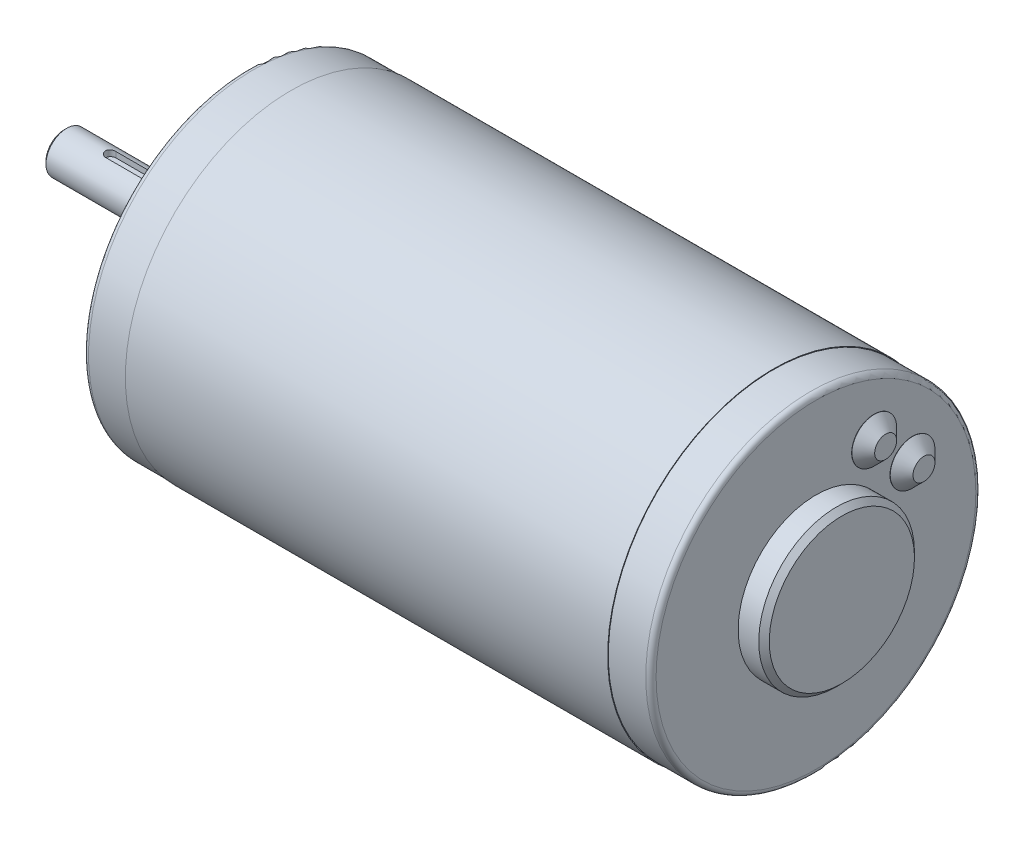
ISO-10303-21;
HEADER;
FILE_DESCRIPTION(('STEP AP214'),'2;1');
FILE_NAME('part.step','',(''),(''),'','','');
FILE_SCHEMA(('AUTOMOTIVE_DESIGN { 1 0 10303 214 1 1 1 1 }'));
ENDSEC;
DATA;
#1=APPLICATION_CONTEXT('core data for automotive mechanical design processes');
#2=APPLICATION_PROTOCOL_DEFINITION('international standard','automotive_design',2000,#1);
#3=PRODUCT_CONTEXT('',#1,'mechanical');
#4=PRODUCT('Part','Part','',(#3));
#5=PRODUCT_RELATED_PRODUCT_CATEGORY('part','',(#4));
#6=PRODUCT_DEFINITION_FORMATION('','',#4);
#7=PRODUCT_DEFINITION_CONTEXT('part definition',#1,'design');
#8=PRODUCT_DEFINITION('design','',#6,#7);
#9=PRODUCT_DEFINITION_SHAPE('','',#8);
#10=(LENGTH_UNIT() NAMED_UNIT(*) SI_UNIT(.MILLI.,.METRE.));
#11=(NAMED_UNIT(*) PLANE_ANGLE_UNIT() SI_UNIT($,.RADIAN.));
#12=(NAMED_UNIT(*) SI_UNIT($,.STERADIAN.) SOLID_ANGLE_UNIT());
#13=UNCERTAINTY_MEASURE_WITH_UNIT(LENGTH_MEASURE(1.E-05),#10,'distance_accuracy_value','');
#14=(GEOMETRIC_REPRESENTATION_CONTEXT(3) GLOBAL_UNCERTAINTY_ASSIGNED_CONTEXT((#13)) GLOBAL_UNIT_ASSIGNED_CONTEXT((#10,
#11,#12)) REPRESENTATION_CONTEXT('',''));
#15=CARTESIAN_POINT('',(0.,0.,0.));
#16=DIRECTION('',(0.,0.,1.));
#17=DIRECTION('',(1.,0.,0.));
#18=AXIS2_PLACEMENT_3D('',#15,#16,#17);
#19=CARTESIAN_POINT('',(-27.6,2.79999999999999,-1.));
#20=DIRECTION('',(0.,-1.,0.));
#21=DIRECTION('',(0.,0.,-1.));
#22=AXIS2_PLACEMENT_3D('',#19,#20,#21);
#23=PLANE('',#22);
#24=CARTESIAN_POINT('',(-7.1,2.79999999999999,0.));
#25=DIRECTION('',(0.,1.,0.));
#26=DIRECTION('',(0.,0.,1.));
#27=AXIS2_PLACEMENT_3D('',#24,#25,#26);
#28=CIRCLE('',#27,1.);
#29=CARTESIAN_POINT('',(-7.1,2.79999999999999,1.));
#30=VERTEX_POINT('',#29);
#31=CARTESIAN_POINT('',(-7.1,2.79999999999999,-1.));
#32=VERTEX_POINT('',#31);
#33=EDGE_CURVE('E81',#30,#32,#28,.T.);
#34=ORIENTED_EDGE('',*,*,#33,.T.);
#35=DIRECTION('',(1.,0.,0.));
#36=VECTOR('',#35,1.);
#37=CARTESIAN_POINT('',(-27.6,2.79999999999999,-1.));
#38=LINE('',#37,#36);
#39=CARTESIAN_POINT('',(-26.6,2.79999999999999,-1.));
#40=VERTEX_POINT('',#39);
#41=EDGE_CURVE('E76',#40,#32,#38,.T.);
#42=ORIENTED_EDGE('',*,*,#41,.F.);
#43=CARTESIAN_POINT('',(-26.6,2.79999999999999,0.));
#44=DIRECTION('',(0.,-1.,0.));
#45=DIRECTION('',(0.,0.,-1.));
#46=AXIS2_PLACEMENT_3D('',#43,#44,#45);
#47=CIRCLE('',#46,1.);
#48=CARTESIAN_POINT('',(-26.6,2.79999999999999,1.));
#49=VERTEX_POINT('',#48);
#50=EDGE_CURVE('E78',#40,#49,#47,.F.);
#51=ORIENTED_EDGE('',*,*,#50,.T.);
#52=DIRECTION('',(1.,0.,0.));
#53=VECTOR('',#52,1.);
#54=CARTESIAN_POINT('',(-27.6,2.79999999999999,1.));
#55=LINE('',#54,#53);
#56=EDGE_CURVE('E104',#49,#30,#55,.T.);
#57=ORIENTED_EDGE('',*,*,#56,.T.);
#58=EDGE_LOOP('',(#34,#42,#51,#57));
#59=FACE_BOUND('',#58,.T.);
#60=ADVANCED_FACE('F18',(#59),#23,.F.);
#61=CARTESIAN_POINT('',(-35.6,0.,0.));
#62=DIRECTION('',(-1.,0.,0.));
#63=DIRECTION('',(0.,0.,1.));
#64=AXIS2_PLACEMENT_3D('',#61,#62,#63);
#65=PLANE('',#64);
#66=CARTESIAN_POINT('',(-35.6000000000449,0.,0.));
#67=DIRECTION('',(1.,0.,0.));
#68=DIRECTION('',(0.,0.,-1.));
#69=AXIS2_PLACEMENT_3D('',#66,#67,#68);
#70=CIRCLE('',#69,3.49999999997408);
#71=CARTESIAN_POINT('',(-35.6000000000449,0.,-3.49999999997408));
#72=VERTEX_POINT('',#71);
#73=EDGE_CURVE('E326',#72,#72,#70,.T.);
#74=ORIENTED_EDGE('',*,*,#73,.F.);
#75=EDGE_LOOP('',(#74));
#76=FACE_BOUND('',#75,.T.);
#77=ADVANCED_FACE('F582',(#76),#65,.T.);
#78=CARTESIAN_POINT('',(-26.6,3.87298334620741,0.));
#79=DIRECTION('',(0.,-1.,0.));
#80=DIRECTION('',(0.,0.,-1.));
#81=AXIS2_PLACEMENT_3D('',#78,#79,#80);
#82=CYLINDRICAL_SURFACE('',#81,1.);
#83=CARTESIAN_POINT('',(-26.6,3.87298334620741,1.));
#84=CARTESIAN_POINT('',(-26.6276629851065,3.87298148580177,1.00000033749611));
#85=CARTESIAN_POINT('',(-26.6553122630182,3.8732800994947,0.998851407375366));
#86=CARTESIAN_POINT('',(-26.7104040353036,3.87445904774558,0.994271295395754));
#87=CARTESIAN_POINT('',(-26.7378465636871,3.87533928441687,0.990840497572679));
#88=CARTESIAN_POINT('',(-26.8194531732088,3.87881710972053,0.977175239382526));
#89=CARTESIAN_POINT('',(-26.8730564684822,3.88225203148808,0.963567695172493));
#90=CARTESIAN_POINT('',(-26.977124673782,3.89095422588002,0.927798076247996));
#91=CARTESIAN_POINT('',(-27.0275898782129,3.89622132630929,0.905636805423835));
#92=CARTESIAN_POINT('',(-27.1241114486473,3.90799134471939,0.853415378025864));
#93=CARTESIAN_POINT('',(-27.170166627891,3.91449459395647,0.823353103356932));
#94=CARTESIAN_POINT('',(-27.2575438819061,3.92816262398025,0.755484471828069));
#95=CARTESIAN_POINT('',(-27.2987548862455,3.93533791028915,0.717537268783975));
#96=CARTESIAN_POINT('',(-27.3743020894827,3.94945104396193,0.635275780516229));
#97=CARTESIAN_POINT('',(-27.4086371894679,3.95638885322537,0.59096047947883));
#98=CARTESIAN_POINT('',(-27.4699110016186,3.96936182283248,0.496456899401689));
#99=CARTESIAN_POINT('',(-27.496739895984,3.9753830468173,0.446195340334472));
#100=CARTESIAN_POINT('',(-27.5415247341967,3.98572346250588,0.341702590842916));
#101=CARTESIAN_POINT('',(-27.5594824242998,3.990042989147,0.287472184083007));
#102=CARTESIAN_POINT('',(-27.5856589927774,3.99641900005128,0.177744108525158));
#103=CARTESIAN_POINT('',(-27.5940676724228,3.998519529013,0.122294322002856));
#104=CARTESIAN_POINT('',(-27.6015033715433,4.00037438150815,0.0107327756816781));
#105=CARTESIAN_POINT('',(-27.6005315701923,4.00012899993444,-0.0453789000287067));
#106=CARTESIAN_POINT('',(-27.5893700363146,3.99735237365735,-0.155352492972096));
#107=CARTESIAN_POINT('',(-27.5793853834005,3.9948719867736,-0.209236701739855));
#108=CARTESIAN_POINT('',(-27.5508113208173,3.98796330636495,-0.31453871108434));
#109=CARTESIAN_POINT('',(-27.5322215304314,3.98353492665556,-0.365956402423988));
#110=CARTESIAN_POINT('',(-27.4867987193294,3.97314997761798,-0.46540728602454));
#111=CARTESIAN_POINT('',(-27.4598926057672,3.96717993827555,-0.513405629602248));
#112=CARTESIAN_POINT('',(-27.3986568701665,3.95435945541919,-0.604276631230015));
#113=CARTESIAN_POINT('',(-27.3643261297468,3.94750887933198,-0.64714851556229));
#114=CARTESIAN_POINT('',(-27.2881210879187,3.93345566022865,-0.727769389708492));
#115=CARTESIAN_POINT('',(-27.2460683634602,3.92624850477685,-0.765349103054128));
#116=CARTESIAN_POINT('',(-27.1561701330723,3.91246168284006,-0.832969575186237));
#117=CARTESIAN_POINT('',(-27.1083230467164,3.90588218842993,-0.863008270245062));
#118=CARTESIAN_POINT('',(-27.0078544021762,3.89407813586325,-0.914804709285961));
#119=CARTESIAN_POINT('',(-26.9552085351039,3.88886106009136,-0.936517017887269));
#120=CARTESIAN_POINT('',(-26.8468830715817,3.88047058807054,-0.970702351849828));
#121=CARTESIAN_POINT('',(-26.7912081448502,3.87729413761435,-0.983189189212131));
#122=CARTESIAN_POINT('',(-26.7125426192411,3.87455290681524,-0.993904635150938));
#123=CARTESIAN_POINT('',(-26.6900802967868,3.87396523110859,-0.996190790966708));
#124=CARTESIAN_POINT('',(-26.6450822100907,3.87318062488974,-0.999236757697394));
#125=CARTESIAN_POINT('',(-26.6225466240447,3.87298306219461,-0.999999038096045));
#126=CARTESIAN_POINT('',(-26.6,3.87298334620741,-1.));
#127=B_SPLINE_CURVE_WITH_KNOTS('',3,(#83,#84,#85,#86,#87,#88,#89,#90,#91,#92,#93,#94,#95,#96,
#97,#98,#99,#100,#101,#102,#103,#104,#105,#106,#107,#108,#109,#110,#111,#112,#113,#114,#115,
#116,#117,#118,#119,#120,#121,#122,#123,#124,#125,#126),.UNSPECIFIED.,.F.,.F.,(4,2,2,2,2,2,2,2,
2,2,2,2,2,2,2,2,2,2,2,2,2,4),(0.,0.0829365303397727,0.165859106084653,0.331229963080318,
0.496585282091499,0.661984974726751,0.830641897427976,0.999325753539196,1.17036187098235,
1.34136430732425,1.50890481515325,1.67642426256639,1.84022545479276,2.00403389475838,
2.16932509450376,2.33464120964329,2.50441429534542,2.67423379180967,2.84496720161068,
3.01544447539986,3.08315848722649,3.15076267731671),.UNSPECIFIED.);
#128=CARTESIAN_POINT('',(-26.6,3.87298334620741,1.));
#129=VERTEX_POINT('',#128);
#130=CARTESIAN_POINT('',(-26.6,3.87298334620741,-1.));
#131=VERTEX_POINT('',#130);
#132=EDGE_CURVE('E162',#129,#131,#127,.T.);
#133=ORIENTED_EDGE('',*,*,#132,.F.);
#134=DIRECTION('',(0.,1.,0.));
#135=VECTOR('',#134,1.);
#136=CARTESIAN_POINT('',(-26.6,2.79999999999999,1.));
#137=LINE('',#136,#135);
#138=EDGE_CURVE('E91',#129,#49,#137,.F.);
#139=ORIENTED_EDGE('',*,*,#138,.T.);
#140=ORIENTED_EDGE('',*,*,#50,.F.);
#141=DIRECTION('',(0.,1.,0.));
#142=VECTOR('',#141,1.);
#143=CARTESIAN_POINT('',(-26.6,2.79999999999999,-1.));
#144=LINE('',#143,#142);
#145=EDGE_CURVE('E85',#131,#40,#144,.F.);
#146=ORIENTED_EDGE('',*,*,#145,.F.);
#147=EDGE_LOOP('',(#133,#139,#140,#146));
#148=FACE_BOUND('',#147,.T.);
#149=ADVANCED_FACE('F88',(#148),#82,.F.);
#150=CARTESIAN_POINT('',(-27.6,2.79999999999999,-1.));
#151=DIRECTION('',(0.,0.,1.));
#152=DIRECTION('',(1.,0.,0.));
#153=AXIS2_PLACEMENT_3D('',#150,#151,#152);
#154=PLANE('',#153);
#155=DIRECTION('',(1.,0.,0.));
#156=VECTOR('',#155,1.);
#157=CARTESIAN_POINT('',(0.,3.87298334620741,-1.));
#158=LINE('',#157,#156);
#159=CARTESIAN_POINT('',(-7.1,3.87298334620741,-1.));
#160=VERTEX_POINT('',#159);
#161=EDGE_CURVE('E96',#131,#160,#158,.T.);
#162=ORIENTED_EDGE('',*,*,#161,.F.);
#163=ORIENTED_EDGE('',*,*,#145,.T.);
#164=ORIENTED_EDGE('',*,*,#41,.T.);
#165=DIRECTION('',(0.,1.,0.));
#166=VECTOR('',#165,1.);
#167=CARTESIAN_POINT('',(-7.1,2.79999999999999,-1.));
#168=LINE('',#167,#166);
#169=EDGE_CURVE('E99',#32,#160,#168,.T.);
#170=ORIENTED_EDGE('',*,*,#169,.T.);
#171=EDGE_LOOP('',(#162,#163,#164,#170));
#172=FACE_BOUND('',#171,.T.);
#173=ADVANCED_FACE('F94',(#172),#154,.T.);
#174=CARTESIAN_POINT('',(-7.1,2.79999999999999,0.));
#175=DIRECTION('',(0.,1.,0.));
#176=DIRECTION('',(0.,0.,1.));
#177=AXIS2_PLACEMENT_3D('',#174,#175,#176);
#178=CYLINDRICAL_SURFACE('',#177,1.);
#179=ORIENTED_EDGE('',*,*,#33,.F.);
#180=DIRECTION('',(0.,1.,0.));
#181=VECTOR('',#180,1.);
#182=CARTESIAN_POINT('',(-7.1,2.79999999999999,1.));
#183=LINE('',#182,#181);
#184=CARTESIAN_POINT('',(-7.1,3.87298334620741,1.));
#185=VERTEX_POINT('',#184);
#186=EDGE_CURVE('E105',#30,#185,#183,.T.);
#187=ORIENTED_EDGE('',*,*,#186,.T.);
#188=CARTESIAN_POINT('',(-7.1,3.87298334620741,-1.));
#189=CARTESIAN_POINT('',(-7.07233701489346,3.87298148580177,-1.00000033749611));
#190=CARTESIAN_POINT('',(-7.04468773698177,3.8732800994947,-0.998851407375366));
#191=CARTESIAN_POINT('',(-6.98959596469644,3.87445904774558,-0.994271295395754));
#192=CARTESIAN_POINT('',(-6.96215343631291,3.87533928441687,-0.990840497572679));
#193=CARTESIAN_POINT('',(-6.88054682679116,3.87881710972053,-0.977175239382526));
#194=CARTESIAN_POINT('',(-6.82694353151779,3.88225203148808,-0.963567695172493));
#195=CARTESIAN_POINT('',(-6.72287532621804,3.89095422588002,-0.927798076247997));
#196=CARTESIAN_POINT('',(-6.67241012178714,3.89622132630929,-0.905636805423836));
#197=CARTESIAN_POINT('',(-6.57588855135267,3.90799134471939,-0.853415378025865));
#198=CARTESIAN_POINT('',(-6.52983337210904,3.91449459395647,-0.823353103356933));
#199=CARTESIAN_POINT('',(-6.4424561180939,3.92816262398025,-0.755484471828069));
#200=CARTESIAN_POINT('',(-6.40124511375448,3.93533791028915,-0.717537268783976));
#201=CARTESIAN_POINT('',(-6.32569791051729,3.94945104396193,-0.63527578051623));
#202=CARTESIAN_POINT('',(-6.29136281053206,3.95638885322537,-0.590960479478831));
#203=CARTESIAN_POINT('',(-6.23008899838136,3.96936182283248,-0.496456899401691));
#204=CARTESIAN_POINT('',(-6.20326010401603,3.9753830468173,-0.446195340334474));
#205=CARTESIAN_POINT('',(-6.1584752658033,3.98572346250588,-0.341702590842919));
#206=CARTESIAN_POINT('',(-6.14051757570017,3.990042989147,-0.28747218408301));
#207=CARTESIAN_POINT('',(-6.11434100722257,3.99641900005128,-0.17774410852516));
#208=CARTESIAN_POINT('',(-6.10593232757718,3.998519529013,-0.122294322002858));
#209=CARTESIAN_POINT('',(-6.09849662845671,4.00037438150815,-0.0107327756816796));
#210=CARTESIAN_POINT('',(-6.09946842980766,4.00012899993444,0.0453789000287057));
#211=CARTESIAN_POINT('',(-6.11062996368545,3.99735237365735,0.155352492972096));
#212=CARTESIAN_POINT('',(-6.12061461659948,3.9948719867736,0.209236701739855));
#213=CARTESIAN_POINT('',(-6.14918867918275,3.98796330636495,0.31453871108434));
#214=CARTESIAN_POINT('',(-6.16777846956858,3.98353492665556,0.365956402423988));
#215=CARTESIAN_POINT('',(-6.21320128067065,3.97314997761798,0.465407286024539));
#216=CARTESIAN_POINT('',(-6.24010739423284,3.96717993827555,0.513405629602248));
#217=CARTESIAN_POINT('',(-6.30134312983347,3.95435945541919,0.604276631230014));
#218=CARTESIAN_POINT('',(-6.33567387025322,3.94750887933198,0.647148515562289));
#219=CARTESIAN_POINT('',(-6.41187891208131,3.93345566022865,0.72776938970849));
#220=CARTESIAN_POINT('',(-6.45393163653981,3.92624850477685,0.765349103054127));
#221=CARTESIAN_POINT('',(-6.54382986692773,3.91246168284006,0.832969575186237));
#222=CARTESIAN_POINT('',(-6.59167695328356,3.90588218842993,0.863008270245062));
#223=CARTESIAN_POINT('',(-6.69214559782377,3.89407813586325,0.914804709285962));
#224=CARTESIAN_POINT('',(-6.74479146489609,3.88886106009136,0.936517017887269));
#225=CARTESIAN_POINT('',(-6.85311692841829,3.88047058807055,0.970702351849829));
#226=CARTESIAN_POINT('',(-6.90879185514984,3.87729413761435,0.983189189212132));
#227=CARTESIAN_POINT('',(-6.9874573807589,3.87455290681524,0.993904635150938));
#228=CARTESIAN_POINT('',(-7.00991970321318,3.87396523110859,0.996190790966708));
#229=CARTESIAN_POINT('',(-7.05491778990932,3.87318062488974,0.999236757697394));
#230=CARTESIAN_POINT('',(-7.07745337595529,3.87298306219461,0.999999038096045));
#231=CARTESIAN_POINT('',(-7.1,3.87298334620741,1.));
#232=B_SPLINE_CURVE_WITH_KNOTS('',3,(#188,#189,#190,#191,#192,#193,#194,#195,#196,#197,#198,
#199,#200,#201,#202,#203,#204,#205,#206,#207,#208,#209,#210,#211,#212,#213,#214,#215,#216,#217,
#218,#219,#220,#221,#222,#223,#224,#225,#226,#227,#228,#229,#230,#231),.UNSPECIFIED.,.F.,.F.,(4,
2,2,2,2,2,2,2,2,2,2,2,2,2,2,2,2,2,2,2,2,4),(0.,0.0829365303397693,0.165859106084651,
0.331229963080317,0.496585282091498,0.661984974726749,0.830641897427974,0.999325753539193,
1.17036187098235,1.34136430732424,1.50890481515325,1.67642426256639,1.84022545479276,
2.00403389475838,2.16932509450376,2.33464120964329,2.50441429534542,2.67423379180967,
2.84496720161068,3.01544447539986,3.08315848722648,3.15076267731671),.UNSPECIFIED.);
#233=EDGE_CURVE('E153',#160,#185,#232,.T.);
#234=ORIENTED_EDGE('',*,*,#233,.F.);
#235=ORIENTED_EDGE('',*,*,#169,.F.);
#236=EDGE_LOOP('',(#179,#187,#234,#235));
#237=FACE_BOUND('',#236,.T.);
#238=ADVANCED_FACE('F168',(#237),#178,.F.);
#239=CARTESIAN_POINT('',(-27.6,2.79999999999999,1.));
#240=DIRECTION('',(0.,0.,1.));
#241=DIRECTION('',(1.,0.,0.));
#242=AXIS2_PLACEMENT_3D('',#239,#240,#241);
#243=PLANE('',#242);
#244=ORIENTED_EDGE('',*,*,#186,.F.);
#245=ORIENTED_EDGE('',*,*,#56,.F.);
#246=ORIENTED_EDGE('',*,*,#138,.F.);
#247=DIRECTION('',(1.,0.,0.));
#248=VECTOR('',#247,1.);
#249=CARTESIAN_POINT('',(0.,3.87298334620741,1.));
#250=LINE('',#249,#248);
#251=EDGE_CURVE('E161',#185,#129,#250,.F.);
#252=ORIENTED_EDGE('',*,*,#251,.F.);
#253=EDGE_LOOP('',(#244,#245,#246,#252));
#254=FACE_BOUND('',#253,.T.);
#255=ADVANCED_FACE('F183',(#254),#243,.F.);
#256=CARTESIAN_POINT('',(-35.0999999999999,0.,0.));
#257=DIRECTION('',(1.,0.,0.));
#258=DIRECTION('',(0.,0.,-1.));
#259=AXIS2_PLACEMENT_3D('',#256,#257,#258);
#260=CONICAL_SURFACE('',#259,3.99999999996226,0.785398163340605);
#261=ORIENTED_EDGE('',*,*,#73,.T.);
#262=EDGE_LOOP('',(#261));
#263=FACE_BOUND('',#262,.T.);
#264=CARTESIAN_POINT('',(-35.1,0.,0.));
#265=DIRECTION('',(1.,0.,0.));
#266=DIRECTION('',(0.,0.,-1.));
#267=AXIS2_PLACEMENT_3D('',#264,#265,#266);
#268=CIRCLE('',#267,4.);
#269=CARTESIAN_POINT('',(-35.1,0.,-4.));
#270=VERTEX_POINT('',#269);
#271=EDGE_CURVE('E152',#270,#270,#268,.T.);
#272=ORIENTED_EDGE('',*,*,#271,.F.);
#273=EDGE_LOOP('',(#272));
#274=FACE_BOUND('',#273,.T.);
#275=ADVANCED_FACE('F178',(#263,#274),#260,.T.);
#276=CARTESIAN_POINT('',(0.,0.,0.));
#277=DIRECTION('',(1.,0.,0.));
#278=DIRECTION('',(0.,0.,-1.));
#279=AXIS2_PLACEMENT_3D('',#276,#277,#278);
#280=CYLINDRICAL_SURFACE('',#279,4.);
#281=ORIENTED_EDGE('',*,*,#271,.T.);
#282=EDGE_LOOP('',(#281));
#283=FACE_BOUND('',#282,.T.);
#284=CARTESIAN_POINT('',(-4.,0.,0.));
#285=DIRECTION('',(1.,0.,0.));
#286=DIRECTION('',(0.,0.,-1.));
#287=AXIS2_PLACEMENT_3D('',#284,#285,#286);
#288=CIRCLE('',#287,4.);
#289=CARTESIAN_POINT('',(-4.,0.,-4.));
#290=VERTEX_POINT('',#289);
#291=EDGE_CURVE('E149',#290,#290,#288,.T.);
#292=ORIENTED_EDGE('',*,*,#291,.F.);
#293=EDGE_LOOP('',(#292));
#294=FACE_BOUND('',#293,.T.);
#295=ORIENTED_EDGE('',*,*,#233,.T.);
#296=ORIENTED_EDGE('',*,*,#251,.T.);
#297=ORIENTED_EDGE('',*,*,#132,.T.);
#298=ORIENTED_EDGE('',*,*,#161,.T.);
#299=EDGE_LOOP('',(#295,#296,#297,#298));
#300=FACE_BOUND('',#299,.T.);
#301=ADVANCED_FACE('F172',(#283,#294,#300),#280,.T.);
#302=CARTESIAN_POINT('',(-4.,4.,0.));
#303=DIRECTION('',(-1.,0.,0.));
#304=DIRECTION('',(0.,0.,1.));
#305=AXIS2_PLACEMENT_3D('',#302,#303,#304);
#306=PLANE('',#305);
#307=ORIENTED_EDGE('',*,*,#291,.T.);
#308=EDGE_LOOP('',(#307));
#309=FACE_BOUND('',#308,.T.);
#310=CARTESIAN_POINT('',(-4.,0.,0.));
#311=DIRECTION('',(1.,0.,0.));
#312=DIRECTION('',(0.,1.,0.));
#313=AXIS2_PLACEMENT_3D('',#310,#311,#312);
#314=CIRCLE('',#313,8.509);
#315=CARTESIAN_POINT('',(-4.,8.509,0.));
#316=VERTEX_POINT('',#315);
#317=EDGE_CURVE('E146',#316,#316,#314,.T.);
#318=ORIENTED_EDGE('',*,*,#317,.F.);
#319=EDGE_LOOP('',(#318));
#320=FACE_BOUND('',#319,.T.);
#321=ADVANCED_FACE('F177',(#309,#320),#306,.T.);
#322=CARTESIAN_POINT('',(111.8479,18.6070906828553,-11.2073596390943));
#323=DIRECTION('',(1.,0.,0.));
#324=DIRECTION('',(0.,0.,-1.));
#325=AXIS2_PLACEMENT_3D('',#322,#323,#324);
#326=PLANE('',#325);
#327=CARTESIAN_POINT('',(111.84789999993,18.6070906828553,-11.2073596390943));
#328=DIRECTION('',(-1.,0.,0.));
#329=DIRECTION('',(0.,-1.,0.));
#330=AXIS2_PLACEMENT_3D('',#327,#328,#329);
#331=CIRCLE('',#330,2.11800000003146);
#332=CARTESIAN_POINT('',(111.84789999993,16.4890906828238,-11.2073596390943));
#333=VERTEX_POINT('',#332);
#334=EDGE_CURVE('E143',#333,#333,#331,.T.);
#335=ORIENTED_EDGE('',*,*,#334,.F.);
#336=EDGE_LOOP('',(#335));
#337=FACE_BOUND('',#336,.T.);
#338=ADVANCED_FACE('F534',(#337),#326,.T.);
#339=CARTESIAN_POINT('',(114.6,15.0368,0.));
#340=DIRECTION('',(1.,0.,0.));
#341=DIRECTION('',(0.,0.,-1.));
#342=AXIS2_PLACEMENT_3D('',#339,#340,#341);
#343=PLANE('',#342);
#344=CARTESIAN_POINT('',(114.6,0.,0.));
#345=DIRECTION('',(-1.,0.,0.));
#346=DIRECTION('',(0.,-1.,0.));
#347=AXIS2_PLACEMENT_3D('',#344,#345,#346);
#348=CIRCLE('',#347,14.0208);
#349=CARTESIAN_POINT('',(114.6,-14.0208,0.));
#350=VERTEX_POINT('',#349);
#351=EDGE_CURVE('E140',#350,#350,#348,.T.);
#352=ORIENTED_EDGE('',*,*,#351,.F.);
#353=EDGE_LOOP('',(#352));
#354=FACE_BOUND('',#353,.T.);
#355=ADVANCED_FACE('F525',(#354),#343,.T.);
#356=CARTESIAN_POINT('',(111.8479,11.2073596390943,-18.6070906828553));
#357=DIRECTION('',(1.,0.,0.));
#358=DIRECTION('',(0.,0.,-1.));
#359=AXIS2_PLACEMENT_3D('',#356,#357,#358);
#360=PLANE('',#359);
#361=CARTESIAN_POINT('',(111.84789999993,11.2073596390943,-18.6070906828553));
#362=DIRECTION('',(-1.,0.,0.));
#363=DIRECTION('',(0.,0.,1.));
#364=AXIS2_PLACEMENT_3D('',#361,#362,#363);
#365=CIRCLE('',#364,2.1180000000021);
#366=CARTESIAN_POINT('',(111.84789999993,11.2073596390943,-16.4890906828532));
#367=VERTEX_POINT('',#366);
#368=EDGE_CURVE('E136',#367,#367,#365,.T.);
#369=ORIENTED_EDGE('',*,*,#368,.F.);
#370=EDGE_LOOP('',(#369));
#371=FACE_BOUND('',#370,.T.);
#372=ADVANCED_FACE('F516',(#371),#360,.T.);
#373=CARTESIAN_POINT('',(13.6143999999945,25.4,0.));
#374=DIRECTION('',(-1.,0.,0.));
#375=DIRECTION('',(0.,0.,1.));
#376=AXIS2_PLACEMENT_3D('',#373,#374,#375);
#377=CONICAL_SURFACE('',#376,2.01929999997219,1.02974425867198);
#378=CARTESIAN_POINT('',(14.827717847993,25.4,0.));
#379=VERTEX_POINT('',#378);
#380=VERTEX_LOOP('',#379);
#381=FACE_BOUND('',#380,.T.);
#382=CARTESIAN_POINT('',(13.6144,25.4,0.));
#383=DIRECTION('',(-1.,0.,0.));
#384=DIRECTION('',(0.,0.,1.));
#385=AXIS2_PLACEMENT_3D('',#382,#383,#384);
#386=CIRCLE('',#385,2.0193);
#387=CARTESIAN_POINT('',(13.6144,25.4,2.0193));
#388=VERTEX_POINT('',#387);
#389=EDGE_CURVE('E139',#388,#388,#386,.T.);
#390=ORIENTED_EDGE('',*,*,#389,.T.);
#391=EDGE_LOOP('',(#390));
#392=FACE_BOUND('',#391,.T.);
#393=ADVANCED_FACE('F507',(#381,#392),#377,.F.);
#394=CARTESIAN_POINT('',(13.6143999999945,-25.4,0.));
#395=DIRECTION('',(-1.,0.,0.));
#396=DIRECTION('',(0.,0.,1.));
#397=AXIS2_PLACEMENT_3D('',#394,#395,#396);
#398=CONICAL_SURFACE('',#397,2.01929999997219,1.02974425867198);
#399=CARTESIAN_POINT('',(14.827717847993,-25.4,0.));
#400=VERTEX_POINT('',#399);
#401=VERTEX_LOOP('',#400);
#402=FACE_BOUND('',#401,.T.);
#403=CARTESIAN_POINT('',(13.6144,-25.4,0.));
#404=DIRECTION('',(-1.,0.,0.));
#405=DIRECTION('',(0.,0.,1.));
#406=AXIS2_PLACEMENT_3D('',#403,#404,#405);
#407=CIRCLE('',#406,2.0193);
#408=CARTESIAN_POINT('',(13.6144,-25.4,2.0193));
#409=VERTEX_POINT('',#408);
#410=EDGE_CURVE('E316',#409,#409,#407,.T.);
#411=ORIENTED_EDGE('',*,*,#410,.T.);
#412=EDGE_LOOP('',(#411));
#413=FACE_BOUND('',#412,.T.);
#414=ADVANCED_FACE('F498',(#402,#413),#398,.F.);
#415=CARTESIAN_POINT('',(-2.984,0.,0.));
#416=DIRECTION('',(1.,0.,0.));
#417=DIRECTION('',(0.,1.,0.));
#418=AXIS2_PLACEMENT_3D('',#415,#416,#417);
#419=CONICAL_SURFACE('',#418,9.525,0.78539816339745);
#420=ORIENTED_EDGE('',*,*,#317,.T.);
#421=EDGE_LOOP('',(#420));
#422=FACE_BOUND('',#421,.T.);
#423=CARTESIAN_POINT('',(-2.984,0.,0.));
#424=DIRECTION('',(1.,0.,0.));
#425=DIRECTION('',(0.,0.,-1.));
#426=AXIS2_PLACEMENT_3D('',#423,#424,#425);
#427=CIRCLE('',#426,9.525);
#428=CARTESIAN_POINT('',(-2.984,0.,-9.525));
#429=VERTEX_POINT('',#428);
#430=EDGE_CURVE('E313',#429,#429,#427,.T.);
#431=ORIENTED_EDGE('',*,*,#430,.F.);
#432=EDGE_LOOP('',(#431));
#433=FACE_BOUND('',#432,.T.);
#434=ADVANCED_FACE('F489',(#422,#433),#419,.T.);
#435=CARTESIAN_POINT('',(109.647900000027,18.6070906828553,-11.2073596390943));
#436=DIRECTION('',(-1.,0.,0.));
#437=DIRECTION('',(0.,-1.,0.));
#438=AXIS2_PLACEMENT_3D('',#435,#436,#437);
#439=CONICAL_SURFACE('',#438,4.31799999987712,0.785398163384529);
#440=CARTESIAN_POINT('',(109.6479,18.6070906828553,-11.2073596390943));
#441=DIRECTION('',(-1.,0.,0.));
#442=DIRECTION('',(0.,0.,1.));
#443=AXIS2_PLACEMENT_3D('',#440,#441,#442);
#444=CIRCLE('',#443,4.318);
#445=CARTESIAN_POINT('',(109.6479,18.6070906828553,-6.88935963909434));
#446=VERTEX_POINT('',#445);
#447=EDGE_CURVE('E310',#446,#446,#444,.T.);
#448=ORIENTED_EDGE('',*,*,#447,.F.);
#449=EDGE_LOOP('',(#448));
#450=FACE_BOUND('',#449,.T.);
#451=ORIENTED_EDGE('',*,*,#334,.T.);
#452=EDGE_LOOP('',(#451));
#453=FACE_BOUND('',#452,.T.);
#454=ADVANCED_FACE('F480',(#450,#453),#439,.T.);
#455=CARTESIAN_POINT('',(113.584,0.,0.));
#456=DIRECTION('',(-1.,0.,0.));
#457=DIRECTION('',(0.,-1.,0.));
#458=AXIS2_PLACEMENT_3D('',#455,#456,#457);
#459=CONICAL_SURFACE('',#458,15.0368,0.785398163397441);
#460=ORIENTED_EDGE('',*,*,#351,.T.);
#461=EDGE_LOOP('',(#460));
#462=FACE_BOUND('',#461,.T.);
#463=CARTESIAN_POINT('',(113.584,0.,0.));
#464=DIRECTION('',(1.,0.,0.));
#465=DIRECTION('',(0.,0.,-1.));
#466=AXIS2_PLACEMENT_3D('',#463,#464,#465);
#467=CIRCLE('',#466,15.0368);
#468=CARTESIAN_POINT('',(113.584,0.,-15.0368));
#469=VERTEX_POINT('',#468);
#470=EDGE_CURVE('E307',#469,#469,#467,.F.);
#471=ORIENTED_EDGE('',*,*,#470,.F.);
#472=EDGE_LOOP('',(#471));
#473=FACE_BOUND('',#472,.T.);
#474=ADVANCED_FACE('F471',(#462,#473),#459,.T.);
#475=CARTESIAN_POINT('',(109.647900000084,11.2073596390943,-18.6070906828553));
#476=DIRECTION('',(-1.,0.,0.));
#477=DIRECTION('',(0.,0.,1.));
#478=AXIS2_PLACEMENT_3D('',#475,#476,#477);
#479=CONICAL_SURFACE('',#478,4.31799999990461,0.785398163410367);
#480=CARTESIAN_POINT('',(109.6479,11.2073596390943,-18.6070906828553));
#481=DIRECTION('',(-1.,0.,0.));
#482=DIRECTION('',(0.,0.,1.));
#483=AXIS2_PLACEMENT_3D('',#480,#481,#482);
#484=CIRCLE('',#483,4.318);
#485=CARTESIAN_POINT('',(109.6479,11.2073596390943,-14.2890906828553));
#486=VERTEX_POINT('',#485);
#487=EDGE_CURVE('E135',#486,#486,#484,.T.);
#488=ORIENTED_EDGE('',*,*,#487,.F.);
#489=EDGE_LOOP('',(#488));
#490=FACE_BOUND('',#489,.T.);
#491=ORIENTED_EDGE('',*,*,#368,.T.);
#492=EDGE_LOOP('',(#491));
#493=FACE_BOUND('',#492,.T.);
#494=ADVANCED_FACE('F462',(#490,#493),#479,.T.);
#495=CARTESIAN_POINT('',(0.,25.4,0.));
#496=DIRECTION('',(-1.,0.,0.));
#497=DIRECTION('',(0.,0.,1.));
#498=AXIS2_PLACEMENT_3D('',#495,#496,#497);
#499=CYLINDRICAL_SURFACE('',#498,2.0193);
#500=CARTESIAN_POINT('',(0.,25.4,0.));
#501=DIRECTION('',(-1.,0.,0.));
#502=DIRECTION('',(0.,0.,1.));
#503=AXIS2_PLACEMENT_3D('',#500,#501,#502);
#504=CIRCLE('',#503,2.0193);
#505=CARTESIAN_POINT('',(0.,25.4,2.0193));
#506=VERTEX_POINT('',#505);
#507=EDGE_CURVE('E132',#506,#506,#504,.F.);
#508=ORIENTED_EDGE('',*,*,#507,.F.);
#509=EDGE_LOOP('',(#508));
#510=FACE_BOUND('',#509,.T.);
#511=ORIENTED_EDGE('',*,*,#389,.F.);
#512=EDGE_LOOP('',(#511));
#513=FACE_BOUND('',#512,.T.);
#514=ADVANCED_FACE('F453',(#510,#513),#499,.F.);
#515=CARTESIAN_POINT('',(0.,-25.4,0.));
#516=DIRECTION('',(-1.,0.,0.));
#517=DIRECTION('',(0.,0.,1.));
#518=AXIS2_PLACEMENT_3D('',#515,#516,#517);
#519=CYLINDRICAL_SURFACE('',#518,2.0193);
#520=CARTESIAN_POINT('',(0.,-25.4,0.));
#521=DIRECTION('',(-1.,0.,0.));
#522=DIRECTION('',(0.,0.,1.));
#523=AXIS2_PLACEMENT_3D('',#520,#521,#522);
#524=CIRCLE('',#523,2.0193);
#525=CARTESIAN_POINT('',(0.,-25.4,2.0193));
#526=VERTEX_POINT('',#525);
#527=EDGE_CURVE('E129',#526,#526,#524,.F.);
#528=ORIENTED_EDGE('',*,*,#527,.F.);
#529=EDGE_LOOP('',(#528));
#530=FACE_BOUND('',#529,.T.);
#531=ORIENTED_EDGE('',*,*,#410,.F.);
#532=EDGE_LOOP('',(#531));
#533=FACE_BOUND('',#532,.T.);
#534=ADVANCED_FACE('F444',(#530,#533),#519,.F.);
#535=CARTESIAN_POINT('',(0.,0.,0.));
#536=DIRECTION('',(1.,0.,0.));
#537=DIRECTION('',(0.,0.,-1.));
#538=AXIS2_PLACEMENT_3D('',#535,#536,#537);
#539=CYLINDRICAL_SURFACE('',#538,9.525);
#540=ORIENTED_EDGE('',*,*,#430,.T.);
#541=EDGE_LOOP('',(#540));
#542=FACE_BOUND('',#541,.T.);
#543=CARTESIAN_POINT('',(0.,0.,0.));
#544=DIRECTION('',(1.,0.,0.));
#545=DIRECTION('',(0.,0.,-1.));
#546=AXIS2_PLACEMENT_3D('',#543,#544,#545);
#547=CIRCLE('',#546,9.525);
#548=CARTESIAN_POINT('',(0.,0.,-9.525));
#549=VERTEX_POINT('',#548);
#550=EDGE_CURVE('E126',#549,#549,#547,.T.);
#551=ORIENTED_EDGE('',*,*,#550,.F.);
#552=EDGE_LOOP('',(#551));
#553=FACE_BOUND('',#552,.T.);
#554=ADVANCED_FACE('F435',(#542,#553),#539,.T.);
#555=CARTESIAN_POINT('',(111.8479,18.6070906828553,-11.2073596390943));
#556=DIRECTION('',(-1.,0.,0.));
#557=DIRECTION('',(0.,0.,1.));
#558=AXIS2_PLACEMENT_3D('',#555,#556,#557);
#559=CYLINDRICAL_SURFACE('',#558,4.318);
#560=CARTESIAN_POINT('',(109.6,18.6070906828553,-11.2073596390943));
#561=DIRECTION('',(-1.,0.,0.));
#562=DIRECTION('',(0.,0.,1.));
#563=AXIS2_PLACEMENT_3D('',#560,#561,#562);
#564=CIRCLE('',#563,4.318);
#565=CARTESIAN_POINT('',(109.6,18.6070906828553,-6.88935963909434));
#566=VERTEX_POINT('',#565);
#567=EDGE_CURVE('E123',#566,#566,#564,.T.);
#568=ORIENTED_EDGE('',*,*,#567,.F.);
#569=EDGE_LOOP('',(#568));
#570=FACE_BOUND('',#569,.T.);
#571=ORIENTED_EDGE('',*,*,#447,.T.);
#572=EDGE_LOOP('',(#571));
#573=FACE_BOUND('',#572,.T.);
#574=ADVANCED_FACE('F426',(#570,#573),#559,.T.);
#575=CARTESIAN_POINT('',(0.,0.,0.));
#576=DIRECTION('',(1.,0.,0.));
#577=DIRECTION('',(0.,0.,-1.));
#578=AXIS2_PLACEMENT_3D('',#575,#576,#577);
#579=CYLINDRICAL_SURFACE('',#578,15.0368);
#580=CARTESIAN_POINT('',(109.6,0.,0.));
#581=DIRECTION('',(1.,0.,0.));
#582=DIRECTION('',(0.,0.,-1.));
#583=AXIS2_PLACEMENT_3D('',#580,#581,#582);
#584=CIRCLE('',#583,15.0368);
#585=CARTESIAN_POINT('',(109.6,0.,-15.0368));
#586=VERTEX_POINT('',#585);
#587=EDGE_CURVE('E120',#586,#586,#584,.F.);
#588=ORIENTED_EDGE('',*,*,#587,.F.);
#589=EDGE_LOOP('',(#588));
#590=FACE_BOUND('',#589,.T.);
#591=ORIENTED_EDGE('',*,*,#470,.T.);
#592=EDGE_LOOP('',(#591));
#593=FACE_BOUND('',#592,.T.);
#594=ADVANCED_FACE('F418',(#590,#593),#579,.T.);
#595=CARTESIAN_POINT('',(111.8479,11.2073596390943,-18.6070906828553));
#596=DIRECTION('',(-1.,0.,0.));
#597=DIRECTION('',(0.,0.,1.));
#598=AXIS2_PLACEMENT_3D('',#595,#596,#597);
#599=CYLINDRICAL_SURFACE('',#598,4.318);
#600=CARTESIAN_POINT('',(109.6,11.2073596390943,-18.6070906828553));
#601=DIRECTION('',(-1.,0.,0.));
#602=DIRECTION('',(0.,0.,1.));
#603=AXIS2_PLACEMENT_3D('',#600,#601,#602);
#604=CIRCLE('',#603,4.318);
#605=CARTESIAN_POINT('',(109.6,11.2073596390943,-14.2890906828553));
#606=VERTEX_POINT('',#605);
#607=EDGE_CURVE('E116',#606,#606,#604,.T.);
#608=ORIENTED_EDGE('',*,*,#607,.F.);
#609=EDGE_LOOP('',(#608));
#610=FACE_BOUND('',#609,.T.);
#611=ORIENTED_EDGE('',*,*,#487,.T.);
#612=EDGE_LOOP('',(#611));
#613=FACE_BOUND('',#612,.T.);
#614=ADVANCED_FACE('F410',(#610,#613),#599,.T.);
#615=CARTESIAN_POINT('',(0.,9.525,0.));
#616=DIRECTION('',(-1.,0.,0.));
#617=DIRECTION('',(0.,0.,1.));
#618=AXIS2_PLACEMENT_3D('',#615,#616,#617);
#619=PLANE('',#618);
#620=ORIENTED_EDGE('',*,*,#550,.T.);
#621=EDGE_LOOP('',(#620));
#622=FACE_BOUND('',#621,.T.);
#623=CARTESIAN_POINT('',(0.,0.,0.));
#624=DIRECTION('',(1.,0.,0.));
#625=DIRECTION('',(0.,0.,-1.));
#626=AXIS2_PLACEMENT_3D('',#623,#624,#625);
#627=CIRCLE('',#626,30.877);
#628=CARTESIAN_POINT('',(0.,0.,-30.877));
#629=VERTEX_POINT('',#628);
#630=CARTESIAN_POINT('',(0.,0.,30.877));
#631=VERTEX_POINT('',#630);
#632=EDGE_CURVE('E119',#629,#631,#627,.T.);
#633=ORIENTED_EDGE('',*,*,#632,.F.);
#634=CARTESIAN_POINT('',(0.,0.,0.));
#635=DIRECTION('',(1.,0.,0.));
#636=DIRECTION('',(0.,0.,1.));
#637=AXIS2_PLACEMENT_3D('',#634,#635,#636);
#638=CIRCLE('',#637,30.877);
#639=EDGE_CURVE('E286',#631,#629,#638,.T.);
#640=ORIENTED_EDGE('',*,*,#639,.F.);
#641=EDGE_LOOP('',(#633,#640));
#642=FACE_BOUND('',#641,.T.);
#643=ORIENTED_EDGE('',*,*,#527,.T.);
#644=EDGE_LOOP('',(#643));
#645=FACE_BOUND('',#644,.T.);
#646=ORIENTED_EDGE('',*,*,#507,.T.);
#647=EDGE_LOOP('',(#646));
#648=FACE_BOUND('',#647,.T.);
#649=ADVANCED_FACE('F252',(#622,#642,#645,#648),#619,.T.);
#650=CARTESIAN_POINT('',(109.6,31.877,0.));
#651=DIRECTION('',(1.,0.,0.));
#652=DIRECTION('',(0.,0.,-1.));
#653=AXIS2_PLACEMENT_3D('',#650,#651,#652);
#654=PLANE('',#653);
#655=ORIENTED_EDGE('',*,*,#607,.T.);
#656=EDGE_LOOP('',(#655));
#657=FACE_BOUND('',#656,.T.);
#658=ORIENTED_EDGE('',*,*,#587,.T.);
#659=EDGE_LOOP('',(#658));
#660=FACE_BOUND('',#659,.T.);
#661=CARTESIAN_POINT('',(109.6,0.,0.));
#662=DIRECTION('',(-1.,0.,0.));
#663=DIRECTION('',(0.,0.,1.));
#664=AXIS2_PLACEMENT_3D('',#661,#662,#663);
#665=CIRCLE('',#664,30.877);
#666=CARTESIAN_POINT('',(109.6,0.,30.877));
#667=VERTEX_POINT('',#666);
#668=CARTESIAN_POINT('',(109.6,0.,-30.877));
#669=VERTEX_POINT('',#668);
#670=EDGE_CURVE('E37',#667,#669,#665,.T.);
#671=ORIENTED_EDGE('',*,*,#670,.F.);
#672=CARTESIAN_POINT('',(109.6,0.,0.));
#673=DIRECTION('',(-1.,0.,0.));
#674=DIRECTION('',(0.,0.,-1.));
#675=AXIS2_PLACEMENT_3D('',#672,#673,#674);
#676=CIRCLE('',#675,30.877);
#677=EDGE_CURVE('E234',#669,#667,#676,.T.);
#678=ORIENTED_EDGE('',*,*,#677,.F.);
#679=EDGE_LOOP('',(#671,#678));
#680=FACE_BOUND('',#679,.T.);
#681=ORIENTED_EDGE('',*,*,#567,.T.);
#682=EDGE_LOOP('',(#681));
#683=FACE_BOUND('',#682,.T.);
#684=ADVANCED_FACE('F243',(#657,#660,#680,#683),#654,.T.);
#685=CARTESIAN_POINT('',(0.999999999999999,0.,0.));
#686=DIRECTION('',(-1.,0.,0.));
#687=DIRECTION('',(0.,0.,1.));
#688=AXIS2_PLACEMENT_3D('',#685,#686,#687);
#689=TOROIDAL_SURFACE('',#688,30.877,1.);
#690=CARTESIAN_POINT('',(0.999999999999999,0.,0.));
#691=DIRECTION('',(1.,0.,0.));
#692=DIRECTION('',(0.,0.,-1.));
#693=AXIS2_PLACEMENT_3D('',#690,#691,#692);
#694=CIRCLE('',#693,31.877);
#695=CARTESIAN_POINT('',(0.999999999999999,0.,-31.877));
#696=VERTEX_POINT('',#695);
#697=EDGE_CURVE('E232',#696,#696,#694,.T.);
#698=ORIENTED_EDGE('',*,*,#697,.F.);
#699=EDGE_LOOP('',(#698));
#700=FACE_BOUND('',#699,.T.);
#701=ORIENTED_EDGE('',*,*,#639,.T.);
#702=ORIENTED_EDGE('',*,*,#632,.T.);
#703=EDGE_LOOP('',(#701,#702));
#704=FACE_BOUND('',#703,.T.);
#705=ADVANCED_FACE('F221',(#700,#704),#689,.T.);
#706=CARTESIAN_POINT('',(108.6,0.,0.));
#707=DIRECTION('',(1.,0.,0.));
#708=DIRECTION('',(0.,0.,-1.));
#709=AXIS2_PLACEMENT_3D('',#706,#707,#708);
#710=TOROIDAL_SURFACE('',#709,30.877,1.);
#711=CARTESIAN_POINT('',(108.6,0.,0.));
#712=DIRECTION('',(1.,0.,0.));
#713=DIRECTION('',(0.,0.,-1.));
#714=AXIS2_PLACEMENT_3D('',#711,#712,#713);
#715=CIRCLE('',#714,31.877);
#716=CARTESIAN_POINT('',(108.6,0.,-31.877));
#717=VERTEX_POINT('',#716);
#718=EDGE_CURVE('E115',#717,#717,#715,.F.);
#719=ORIENTED_EDGE('',*,*,#718,.F.);
#720=EDGE_LOOP('',(#719));
#721=FACE_BOUND('',#720,.T.);
#722=ORIENTED_EDGE('',*,*,#677,.T.);
#723=ORIENTED_EDGE('',*,*,#670,.T.);
#724=EDGE_LOOP('',(#722,#723));
#725=FACE_BOUND('',#724,.T.);
#726=ADVANCED_FACE('F216',(#721,#725),#710,.T.);
#727=CARTESIAN_POINT('',(0.,0.,0.));
#728=DIRECTION('',(1.,0.,0.));
#729=DIRECTION('',(0.,0.,-1.));
#730=AXIS2_PLACEMENT_3D('',#727,#728,#729);
#731=CYLINDRICAL_SURFACE('',#730,31.877);
#732=ORIENTED_EDGE('',*,*,#697,.T.);
#733=EDGE_LOOP('',(#732));
#734=FACE_BOUND('',#733,.T.);
#735=CARTESIAN_POINT('',(8.2296,0.,0.));
#736=DIRECTION('',(1.,0.,0.));
#737=DIRECTION('',(0.,0.,-1.));
#738=AXIS2_PLACEMENT_3D('',#735,#736,#737);
#739=CIRCLE('',#738,31.877);
#740=CARTESIAN_POINT('',(8.2296,0.,-31.877));
#741=VERTEX_POINT('',#740);
#742=EDGE_CURVE('E112',#741,#741,#739,.T.);
#743=ORIENTED_EDGE('',*,*,#742,.F.);
#744=EDGE_LOOP('',(#743));
#745=FACE_BOUND('',#744,.T.);
#746=ADVANCED_FACE('F212',(#734,#745),#731,.T.);
#747=CARTESIAN_POINT('',(0.,0.,0.));
#748=DIRECTION('',(1.,0.,0.));
#749=DIRECTION('',(0.,0.,-1.));
#750=AXIS2_PLACEMENT_3D('',#747,#748,#749);
#751=CYLINDRICAL_SURFACE('',#750,31.877);
#752=CARTESIAN_POINT('',(101.3704,0.,0.));
#753=DIRECTION('',(1.,0.,0.));
#754=DIRECTION('',(0.,0.,-1.));
#755=AXIS2_PLACEMENT_3D('',#752,#753,#754);
#756=CIRCLE('',#755,31.877);
#757=CARTESIAN_POINT('',(101.3704,0.,-31.877));
#758=VERTEX_POINT('',#757);
#759=EDGE_CURVE('E109',#758,#758,#756,.F.);
#760=ORIENTED_EDGE('',*,*,#759,.F.);
#761=EDGE_LOOP('',(#760));
#762=FACE_BOUND('',#761,.T.);
#763=ORIENTED_EDGE('',*,*,#718,.T.);
#764=EDGE_LOOP('',(#763));
#765=FACE_BOUND('',#764,.T.);
#766=ADVANCED_FACE('F208',(#762,#765),#751,.T.);
#767=CARTESIAN_POINT('',(8.2296,31.877,0.));
#768=DIRECTION('',(-1.,0.,0.));
#769=DIRECTION('',(0.,0.,1.));
#770=AXIS2_PLACEMENT_3D('',#767,#768,#769);
#771=PLANE('',#770);
#772=CARTESIAN_POINT('',(8.2296,0.,0.));
#773=DIRECTION('',(1.,0.,0.));
#774=DIRECTION('',(0.,0.,-1.));
#775=AXIS2_PLACEMENT_3D('',#772,#773,#774);
#776=CIRCLE('',#775,32.004);
#777=CARTESIAN_POINT('',(8.2296,0.,-32.004));
#778=VERTEX_POINT('',#777);
#779=EDGE_CURVE('E29',#778,#778,#776,.T.);
#780=ORIENTED_EDGE('',*,*,#779,.F.);
#781=EDGE_LOOP('',(#780));
#782=FACE_BOUND('',#781,.T.);
#783=ORIENTED_EDGE('',*,*,#742,.T.);
#784=EDGE_LOOP('',(#783));
#785=FACE_BOUND('',#784,.T.);
#786=ADVANCED_FACE('F201',(#782,#785),#771,.T.);
#787=CARTESIAN_POINT('',(101.3704,32.004,0.));
#788=DIRECTION('',(1.,0.,0.));
#789=DIRECTION('',(0.,0.,-1.));
#790=AXIS2_PLACEMENT_3D('',#787,#788,#789);
#791=PLANE('',#790);
#792=ORIENTED_EDGE('',*,*,#759,.T.);
#793=EDGE_LOOP('',(#792));
#794=FACE_BOUND('',#793,.T.);
#795=CARTESIAN_POINT('',(101.3704,0.,0.));
#796=DIRECTION('',(1.,0.,0.));
#797=DIRECTION('',(0.,0.,-1.));
#798=AXIS2_PLACEMENT_3D('',#795,#796,#797);
#799=CIRCLE('',#798,32.004);
#800=CARTESIAN_POINT('',(101.3704,0.,-32.004));
#801=VERTEX_POINT('',#800);
#802=EDGE_CURVE('E11',#801,#801,#799,.F.);
#803=ORIENTED_EDGE('',*,*,#802,.F.);
#804=EDGE_LOOP('',(#803));
#805=FACE_BOUND('',#804,.T.);
#806=ADVANCED_FACE('F195',(#794,#805),#791,.T.);
#807=CARTESIAN_POINT('',(0.,0.,0.));
#808=DIRECTION('',(1.,0.,0.));
#809=DIRECTION('',(0.,0.,-1.));
#810=AXIS2_PLACEMENT_3D('',#807,#808,#809);
#811=CYLINDRICAL_SURFACE('',#810,32.004);
#812=ORIENTED_EDGE('',*,*,#802,.T.);
#813=EDGE_LOOP('',(#812));
#814=FACE_BOUND('',#813,.T.);
#815=ORIENTED_EDGE('',*,*,#779,.T.);
#816=EDGE_LOOP('',(#815));
#817=FACE_BOUND('',#816,.T.);
#818=ADVANCED_FACE('F193',(#814,#817),#811,.T.);
#819=CLOSED_SHELL('',(#60,#77,#149,#173,#238,#255,#275,#301,#321,#338,#355,#372,#393,#414,#434,
#454,#474,#494,#514,#534,#554,#574,#594,#614,#649,#684,#705,#726,#746,#766,#786,#806,#818));
#820=MANIFOLD_SOLID_BREP('B1',#819);
#821=ADVANCED_BREP_SHAPE_REPRESENTATION('',(#18,#820),#14);
#822=SHAPE_DEFINITION_REPRESENTATION(#9,#821);
ENDSEC;
END-ISO-10303-21;
